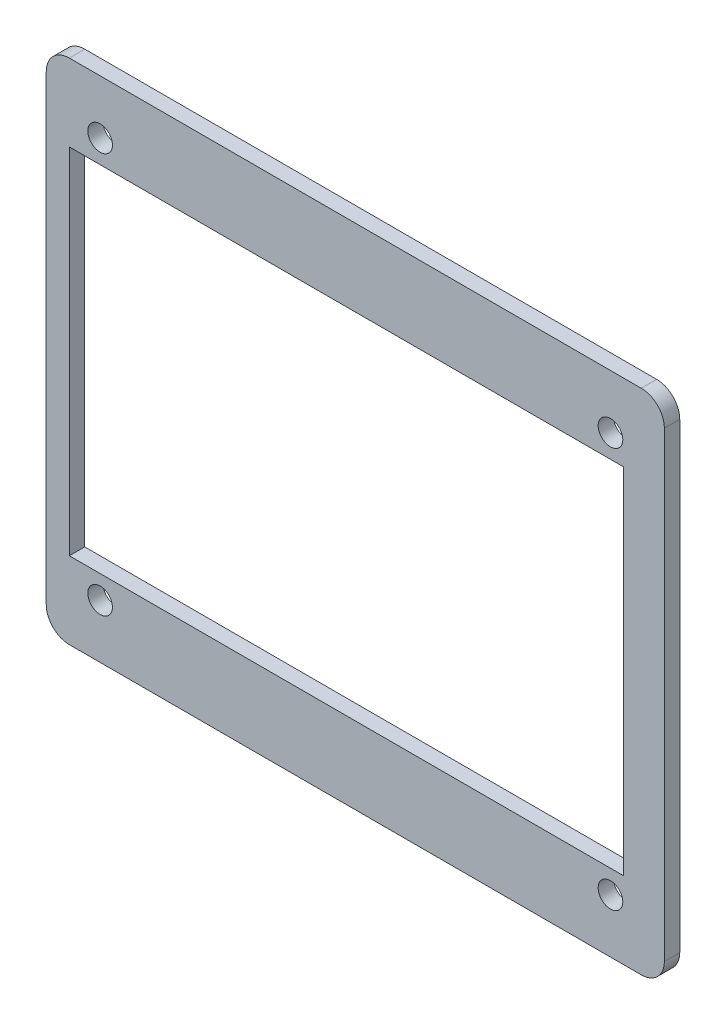
ISO-10303-21;
HEADER;
FILE_DESCRIPTION(('STEP AP214'),'2;1');
FILE_NAME('part.step','',(''),(''),'','','');
FILE_SCHEMA(('AUTOMOTIVE_DESIGN { 1 0 10303 214 1 1 1 1 }'));
ENDSEC;
DATA;
#1=APPLICATION_CONTEXT('core data for automotive mechanical design processes');
#2=APPLICATION_PROTOCOL_DEFINITION('international standard','automotive_design',2000,#1);
#3=PRODUCT_CONTEXT('',#1,'mechanical');
#4=PRODUCT('Part','Part','',(#3));
#5=PRODUCT_RELATED_PRODUCT_CATEGORY('part','',(#4));
#6=PRODUCT_DEFINITION_FORMATION('','',#4);
#7=PRODUCT_DEFINITION_CONTEXT('part definition',#1,'design');
#8=PRODUCT_DEFINITION('design','',#6,#7);
#9=PRODUCT_DEFINITION_SHAPE('','',#8);
#10=(LENGTH_UNIT() NAMED_UNIT(*) SI_UNIT(.MILLI.,.METRE.));
#11=(NAMED_UNIT(*) PLANE_ANGLE_UNIT() SI_UNIT($,.RADIAN.));
#12=(NAMED_UNIT(*) SI_UNIT($,.STERADIAN.) SOLID_ANGLE_UNIT());
#13=UNCERTAINTY_MEASURE_WITH_UNIT(LENGTH_MEASURE(1.E-05),#10,'distance_accuracy_value','');
#14=(GEOMETRIC_REPRESENTATION_CONTEXT(3) GLOBAL_UNCERTAINTY_ASSIGNED_CONTEXT((#13)) GLOBAL_UNIT_ASSIGNED_CONTEXT((#10,
#11,#12)) REPRESENTATION_CONTEXT('',''));
#15=CARTESIAN_POINT('',(0.,0.,0.));
#16=DIRECTION('',(0.,0.,1.));
#17=DIRECTION('',(1.,0.,0.));
#18=AXIS2_PLACEMENT_3D('',#15,#16,#17);
#19=CARTESIAN_POINT('',(0.,0.,2.));
#20=DIRECTION('',(1.,0.,0.));
#21=DIRECTION('',(0.,0.,-1.));
#22=AXIS2_PLACEMENT_3D('',#19,#20,#21);
#23=PLANE('',#22);
#24=DIRECTION('',(0.,-1.,0.));
#25=VECTOR('',#24,1.);
#26=CARTESIAN_POINT('',(0.,0.,0.));
#27=LINE('',#26,#25);
#28=CARTESIAN_POINT('',(0.,63.,0.));
#29=VERTEX_POINT('',#28);
#30=CARTESIAN_POINT('',(0.,3.,0.));
#31=VERTEX_POINT('',#30);
#32=EDGE_CURVE('E180',#29,#31,#27,.T.);
#33=ORIENTED_EDGE('',*,*,#32,.T.);
#34=DIRECTION('',(0.,0.,-1.));
#35=VECTOR('',#34,1.);
#36=CARTESIAN_POINT('',(0.,3.,2.));
#37=LINE('',#36,#35);
#38=CARTESIAN_POINT('',(0.,3.,2.));
#39=VERTEX_POINT('',#38);
#40=EDGE_CURVE('E11',#31,#39,#37,.F.);
#41=ORIENTED_EDGE('',*,*,#40,.T.);
#42=DIRECTION('',(0.,-1.,0.));
#43=VECTOR('',#42,1.);
#44=CARTESIAN_POINT('',(0.,0.,2.));
#45=LINE('',#44,#43);
#46=CARTESIAN_POINT('',(0.,63.,2.));
#47=VERTEX_POINT('',#46);
#48=EDGE_CURVE('E181',#47,#39,#45,.T.);
#49=ORIENTED_EDGE('',*,*,#48,.F.);
#50=DIRECTION('',(0.,0.,-1.));
#51=VECTOR('',#50,1.);
#52=CARTESIAN_POINT('',(0.,63.,2.));
#53=LINE('',#52,#51);
#54=EDGE_CURVE('E40',#47,#29,#53,.T.);
#55=ORIENTED_EDGE('',*,*,#54,.T.);
#56=EDGE_LOOP('',(#33,#41,#49,#55));
#57=FACE_BOUND('',#56,.T.);
#58=ADVANCED_FACE('F32',(#57),#23,.F.);
#59=CARTESIAN_POINT('',(0.,0.,2.));
#60=DIRECTION('',(0.,1.,0.));
#61=DIRECTION('',(0.,0.,1.));
#62=AXIS2_PLACEMENT_3D('',#59,#60,#61);
#63=PLANE('',#62);
#64=DIRECTION('',(1.,0.,0.));
#65=VECTOR('',#64,1.);
#66=CARTESIAN_POINT('',(0.,0.,0.));
#67=LINE('',#66,#65);
#68=CARTESIAN_POINT('',(3.,0.,0.));
#69=VERTEX_POINT('',#68);
#70=CARTESIAN_POINT('',(77.3,0.,0.));
#71=VERTEX_POINT('',#70);
#72=EDGE_CURVE('E197',#69,#71,#67,.T.);
#73=ORIENTED_EDGE('',*,*,#72,.T.);
#74=DIRECTION('',(0.,0.,-1.));
#75=VECTOR('',#74,1.);
#76=CARTESIAN_POINT('',(77.3,0.,2.));
#77=LINE('',#76,#75);
#78=CARTESIAN_POINT('',(77.3,0.,2.));
#79=VERTEX_POINT('',#78);
#80=EDGE_CURVE('E233',#71,#79,#77,.F.);
#81=ORIENTED_EDGE('',*,*,#80,.T.);
#82=DIRECTION('',(1.,0.,0.));
#83=VECTOR('',#82,1.);
#84=CARTESIAN_POINT('',(0.,0.,2.));
#85=LINE('',#84,#83);
#86=CARTESIAN_POINT('',(3.,0.,2.));
#87=VERTEX_POINT('',#86);
#88=EDGE_CURVE('E184',#87,#79,#85,.T.);
#89=ORIENTED_EDGE('',*,*,#88,.F.);
#90=DIRECTION('',(0.,0.,-1.));
#91=VECTOR('',#90,1.);
#92=CARTESIAN_POINT('',(3.,0.,2.));
#93=LINE('',#92,#91);
#94=EDGE_CURVE('E230',#87,#69,#93,.T.);
#95=ORIENTED_EDGE('',*,*,#94,.T.);
#96=EDGE_LOOP('',(#73,#81,#89,#95));
#97=FACE_BOUND('',#96,.T.);
#98=ADVANCED_FACE('F251',(#97),#63,.F.);
#99=CARTESIAN_POINT('',(80.3,0.,2.));
#100=DIRECTION('',(-1.,0.,0.));
#101=DIRECTION('',(0.,0.,1.));
#102=AXIS2_PLACEMENT_3D('',#99,#100,#101);
#103=PLANE('',#102);
#104=DIRECTION('',(0.,1.,0.));
#105=VECTOR('',#104,1.);
#106=CARTESIAN_POINT('',(80.3,0.,0.));
#107=LINE('',#106,#105);
#108=CARTESIAN_POINT('',(80.3,3.,0.));
#109=VERTEX_POINT('',#108);
#110=CARTESIAN_POINT('',(80.3,63.,0.));
#111=VERTEX_POINT('',#110);
#112=EDGE_CURVE('E200',#109,#111,#107,.T.);
#113=ORIENTED_EDGE('',*,*,#112,.T.);
#114=DIRECTION('',(0.,0.,-1.));
#115=VECTOR('',#114,1.);
#116=CARTESIAN_POINT('',(80.3,63.,2.));
#117=LINE('',#116,#115);
#118=CARTESIAN_POINT('',(80.3,63.,2.));
#119=VERTEX_POINT('',#118);
#120=EDGE_CURVE('E220',#111,#119,#117,.F.);
#121=ORIENTED_EDGE('',*,*,#120,.T.);
#122=DIRECTION('',(0.,1.,0.));
#123=VECTOR('',#122,1.);
#124=CARTESIAN_POINT('',(80.3,0.,2.));
#125=LINE('',#124,#123);
#126=CARTESIAN_POINT('',(80.3,3.,2.));
#127=VERTEX_POINT('',#126);
#128=EDGE_CURVE('E188',#127,#119,#125,.T.);
#129=ORIENTED_EDGE('',*,*,#128,.F.);
#130=DIRECTION('',(0.,0.,-1.));
#131=VECTOR('',#130,1.);
#132=CARTESIAN_POINT('',(80.3,3.,2.));
#133=LINE('',#132,#131);
#134=EDGE_CURVE('E217',#127,#109,#133,.T.);
#135=ORIENTED_EDGE('',*,*,#134,.T.);
#136=EDGE_LOOP('',(#113,#121,#129,#135));
#137=FACE_BOUND('',#136,.T.);
#138=ADVANCED_FACE('F262',(#137),#103,.F.);
#139=CARTESIAN_POINT('',(0.,66.,2.));
#140=DIRECTION('',(0.,-1.,0.));
#141=DIRECTION('',(0.,0.,-1.));
#142=AXIS2_PLACEMENT_3D('',#139,#140,#141);
#143=PLANE('',#142);
#144=DIRECTION('',(-1.,0.,0.));
#145=VECTOR('',#144,1.);
#146=CARTESIAN_POINT('',(0.,66.,2.));
#147=LINE('',#146,#145);
#148=CARTESIAN_POINT('',(77.3,66.,2.));
#149=VERTEX_POINT('',#148);
#150=CARTESIAN_POINT('',(3.,66.,2.));
#151=VERTEX_POINT('',#150);
#152=EDGE_CURVE('E191',#149,#151,#147,.T.);
#153=ORIENTED_EDGE('',*,*,#152,.F.);
#154=DIRECTION('',(0.,0.,-1.));
#155=VECTOR('',#154,1.);
#156=CARTESIAN_POINT('',(77.3,66.,2.));
#157=LINE('',#156,#155);
#158=CARTESIAN_POINT('',(77.3,66.,0.));
#159=VERTEX_POINT('',#158);
#160=EDGE_CURVE('E206',#149,#159,#157,.T.);
#161=ORIENTED_EDGE('',*,*,#160,.T.);
#162=DIRECTION('',(-1.,0.,0.));
#163=VECTOR('',#162,1.);
#164=CARTESIAN_POINT('',(0.,66.,0.));
#165=LINE('',#164,#163);
#166=CARTESIAN_POINT('',(3.,66.,0.));
#167=VERTEX_POINT('',#166);
#168=EDGE_CURVE('E185',#159,#167,#165,.T.);
#169=ORIENTED_EDGE('',*,*,#168,.T.);
#170=DIRECTION('',(0.,0.,-1.));
#171=VECTOR('',#170,1.);
#172=CARTESIAN_POINT('',(3.,66.,2.));
#173=LINE('',#172,#171);
#174=EDGE_CURVE('E194',#167,#151,#173,.F.);
#175=ORIENTED_EDGE('',*,*,#174,.T.);
#176=EDGE_LOOP('',(#153,#161,#169,#175));
#177=FACE_BOUND('',#176,.T.);
#178=ADVANCED_FACE('F270',(#177),#143,.F.);
#179=CARTESIAN_POINT('',(0.,0.,2.));
#180=DIRECTION('',(0.,0.,-1.));
#181=DIRECTION('',(-1.,0.,0.));
#182=AXIS2_PLACEMENT_3D('',#179,#180,#181);
#183=PLANE('',#182);
#184=DIRECTION('',(1.,0.,0.));
#185=VECTOR('',#184,1.);
#186=CARTESIAN_POINT('',(3.,10.,2.));
#187=LINE('',#186,#185);
#188=CARTESIAN_POINT('',(3.,10.,2.));
#189=VERTEX_POINT('',#188);
#190=CARTESIAN_POINT('',(75.,10.,2.));
#191=VERTEX_POINT('',#190);
#192=EDGE_CURVE('E147',#189,#191,#187,.T.);
#193=ORIENTED_EDGE('',*,*,#192,.F.);
#194=DIRECTION('',(0.,-1.,0.));
#195=VECTOR('',#194,1.);
#196=CARTESIAN_POINT('',(3.,10.,2.));
#197=LINE('',#196,#195);
#198=CARTESIAN_POINT('',(3.,56.,2.));
#199=VERTEX_POINT('',#198);
#200=EDGE_CURVE('E47',#199,#189,#197,.T.);
#201=ORIENTED_EDGE('',*,*,#200,.F.);
#202=DIRECTION('',(-1.,0.,0.));
#203=VECTOR('',#202,1.);
#204=CARTESIAN_POINT('',(3.,56.,2.));
#205=LINE('',#204,#203);
#206=CARTESIAN_POINT('',(75.,56.,2.));
#207=VERTEX_POINT('',#206);
#208=EDGE_CURVE('E138',#207,#199,#205,.T.);
#209=ORIENTED_EDGE('',*,*,#208,.F.);
#210=DIRECTION('',(0.,1.,0.));
#211=VECTOR('',#210,1.);
#212=CARTESIAN_POINT('',(75.,10.,2.));
#213=LINE('',#212,#211);
#214=EDGE_CURVE('E141',#191,#207,#213,.T.);
#215=ORIENTED_EDGE('',*,*,#214,.F.);
#216=EDGE_LOOP('',(#193,#201,#209,#215));
#217=FACE_BOUND('',#216,.T.);
#218=CARTESIAN_POINT('',(7.,59.,2.));
#219=DIRECTION('',(0.,0.,1.));
#220=DIRECTION('',(1.,0.,0.));
#221=AXIS2_PLACEMENT_3D('',#218,#219,#220);
#222=CIRCLE('',#221,1.59999999999999);
#223=CARTESIAN_POINT('',(8.59999999999999,59.,2.));
#224=VERTEX_POINT('',#223);
#225=EDGE_CURVE('E153',#224,#224,#222,.T.);
#226=ORIENTED_EDGE('',*,*,#225,.F.);
#227=EDGE_LOOP('',(#226));
#228=FACE_BOUND('',#227,.T.);
#229=CARTESIAN_POINT('',(73.3,59.,2.));
#230=DIRECTION('',(0.,0.,1.));
#231=DIRECTION('',(1.,0.,0.));
#232=AXIS2_PLACEMENT_3D('',#229,#230,#231);
#233=CIRCLE('',#232,1.59999999999999);
#234=CARTESIAN_POINT('',(74.9,59.,2.));
#235=VERTEX_POINT('',#234);
#236=EDGE_CURVE('E162',#235,#235,#233,.T.);
#237=ORIENTED_EDGE('',*,*,#236,.F.);
#238=EDGE_LOOP('',(#237));
#239=FACE_BOUND('',#238,.T.);
#240=CARTESIAN_POINT('',(73.3,7.,2.));
#241=DIRECTION('',(0.,0.,1.));
#242=DIRECTION('',(1.,0.,0.));
#243=AXIS2_PLACEMENT_3D('',#240,#241,#242);
#244=CIRCLE('',#243,1.59999999999999);
#245=CARTESIAN_POINT('',(74.9,7.,2.));
#246=VERTEX_POINT('',#245);
#247=EDGE_CURVE('E168',#246,#246,#244,.T.);
#248=ORIENTED_EDGE('',*,*,#247,.F.);
#249=EDGE_LOOP('',(#248));
#250=FACE_BOUND('',#249,.T.);
#251=CARTESIAN_POINT('',(7.00000000000001,7.,2.));
#252=DIRECTION('',(0.,0.,1.));
#253=DIRECTION('',(1.,0.,0.));
#254=AXIS2_PLACEMENT_3D('',#251,#252,#253);
#255=CIRCLE('',#254,1.59999999999999);
#256=CARTESIAN_POINT('',(8.59999999999999,7.,2.));
#257=VERTEX_POINT('',#256);
#258=EDGE_CURVE('E174',#257,#257,#255,.T.);
#259=ORIENTED_EDGE('',*,*,#258,.F.);
#260=EDGE_LOOP('',(#259));
#261=FACE_BOUND('',#260,.T.);
#262=ORIENTED_EDGE('',*,*,#128,.T.);
#263=CARTESIAN_POINT('',(77.3,63.,2.));
#264=DIRECTION('',(0.,0.,-1.));
#265=DIRECTION('',(-1.,0.,0.));
#266=AXIS2_PLACEMENT_3D('',#263,#264,#265);
#267=CIRCLE('',#266,3.);
#268=EDGE_CURVE('E228',#119,#149,#267,.F.);
#269=ORIENTED_EDGE('',*,*,#268,.T.);
#270=ORIENTED_EDGE('',*,*,#152,.T.);
#271=CARTESIAN_POINT('',(3.,63.,2.));
#272=DIRECTION('',(0.,0.,-1.));
#273=DIRECTION('',(-1.,0.,0.));
#274=AXIS2_PLACEMENT_3D('',#271,#272,#273);
#275=CIRCLE('',#274,3.);
#276=EDGE_CURVE('E222',#151,#47,#275,.F.);
#277=ORIENTED_EDGE('',*,*,#276,.T.);
#278=ORIENTED_EDGE('',*,*,#48,.T.);
#279=CARTESIAN_POINT('',(3.,3.,2.));
#280=DIRECTION('',(0.,0.,-1.));
#281=DIRECTION('',(-1.,0.,0.));
#282=AXIS2_PLACEMENT_3D('',#279,#280,#281);
#283=CIRCLE('',#282,3.);
#284=EDGE_CURVE('E224',#39,#87,#283,.F.);
#285=ORIENTED_EDGE('',*,*,#284,.T.);
#286=ORIENTED_EDGE('',*,*,#88,.T.);
#287=CARTESIAN_POINT('',(77.3,3.,2.));
#288=DIRECTION('',(0.,0.,-1.));
#289=DIRECTION('',(-1.,0.,0.));
#290=AXIS2_PLACEMENT_3D('',#287,#288,#289);
#291=CIRCLE('',#290,3.);
#292=EDGE_CURVE('E226',#79,#127,#291,.F.);
#293=ORIENTED_EDGE('',*,*,#292,.T.);
#294=EDGE_LOOP('',(#262,#269,#270,#277,#278,#285,#286,#293));
#295=FACE_BOUND('',#294,.T.);
#296=ADVANCED_FACE('F255',(#217,#228,#239,#250,#261,#295),#183,.F.);
#297=CARTESIAN_POINT('',(0.,0.,0.));
#298=DIRECTION('',(0.,0.,-1.));
#299=DIRECTION('',(-1.,0.,0.));
#300=AXIS2_PLACEMENT_3D('',#297,#298,#299);
#301=PLANE('',#300);
#302=DIRECTION('',(0.,-1.,0.));
#303=VECTOR('',#302,1.);
#304=CARTESIAN_POINT('',(3.,10.,0.));
#305=LINE('',#304,#303);
#306=CARTESIAN_POINT('',(3.,56.,0.));
#307=VERTEX_POINT('',#306);
#308=CARTESIAN_POINT('',(3.,10.,0.));
#309=VERTEX_POINT('',#308);
#310=EDGE_CURVE('E122',#307,#309,#305,.T.);
#311=ORIENTED_EDGE('',*,*,#310,.T.);
#312=DIRECTION('',(1.,0.,0.));
#313=VECTOR('',#312,1.);
#314=CARTESIAN_POINT('',(3.,10.,0.));
#315=LINE('',#314,#313);
#316=CARTESIAN_POINT('',(75.,10.,0.));
#317=VERTEX_POINT('',#316);
#318=EDGE_CURVE('E131',#309,#317,#315,.T.);
#319=ORIENTED_EDGE('',*,*,#318,.T.);
#320=DIRECTION('',(0.,1.,0.));
#321=VECTOR('',#320,1.);
#322=CARTESIAN_POINT('',(75.,10.,0.));
#323=LINE('',#322,#321);
#324=CARTESIAN_POINT('',(75.,56.,0.));
#325=VERTEX_POINT('',#324);
#326=EDGE_CURVE('E55',#317,#325,#323,.T.);
#327=ORIENTED_EDGE('',*,*,#326,.T.);
#328=DIRECTION('',(-1.,0.,0.));
#329=VECTOR('',#328,1.);
#330=CARTESIAN_POINT('',(3.,56.,0.));
#331=LINE('',#330,#329);
#332=EDGE_CURVE('E128',#325,#307,#331,.T.);
#333=ORIENTED_EDGE('',*,*,#332,.T.);
#334=EDGE_LOOP('',(#311,#319,#327,#333));
#335=FACE_BOUND('',#334,.T.);
#336=CARTESIAN_POINT('',(7.,59.,0.));
#337=DIRECTION('',(0.,0.,1.));
#338=DIRECTION('',(1.,0.,0.));
#339=AXIS2_PLACEMENT_3D('',#336,#337,#338);
#340=CIRCLE('',#339,1.6);
#341=CARTESIAN_POINT('',(8.6,59.,0.));
#342=VERTEX_POINT('',#341);
#343=EDGE_CURVE('E159',#342,#342,#340,.T.);
#344=ORIENTED_EDGE('',*,*,#343,.T.);
#345=EDGE_LOOP('',(#344));
#346=FACE_BOUND('',#345,.T.);
#347=CARTESIAN_POINT('',(73.3,59.,0.));
#348=DIRECTION('',(0.,0.,1.));
#349=DIRECTION('',(1.,0.,0.));
#350=AXIS2_PLACEMENT_3D('',#347,#348,#349);
#351=CIRCLE('',#350,1.6);
#352=CARTESIAN_POINT('',(74.9,59.,0.));
#353=VERTEX_POINT('',#352);
#354=EDGE_CURVE('E165',#353,#353,#351,.T.);
#355=ORIENTED_EDGE('',*,*,#354,.T.);
#356=EDGE_LOOP('',(#355));
#357=FACE_BOUND('',#356,.T.);
#358=CARTESIAN_POINT('',(73.3,7.,0.));
#359=DIRECTION('',(0.,0.,1.));
#360=DIRECTION('',(1.,0.,0.));
#361=AXIS2_PLACEMENT_3D('',#358,#359,#360);
#362=CIRCLE('',#361,1.6);
#363=CARTESIAN_POINT('',(74.9,7.,0.));
#364=VERTEX_POINT('',#363);
#365=EDGE_CURVE('E171',#364,#364,#362,.T.);
#366=ORIENTED_EDGE('',*,*,#365,.T.);
#367=EDGE_LOOP('',(#366));
#368=FACE_BOUND('',#367,.T.);
#369=CARTESIAN_POINT('',(7.00000000000001,7.,0.));
#370=DIRECTION('',(0.,0.,1.));
#371=DIRECTION('',(1.,0.,0.));
#372=AXIS2_PLACEMENT_3D('',#369,#370,#371);
#373=CIRCLE('',#372,1.6);
#374=CARTESIAN_POINT('',(8.6,7.,0.));
#375=VERTEX_POINT('',#374);
#376=EDGE_CURVE('E177',#375,#375,#373,.T.);
#377=ORIENTED_EDGE('',*,*,#376,.T.);
#378=EDGE_LOOP('',(#377));
#379=FACE_BOUND('',#378,.T.);
#380=ORIENTED_EDGE('',*,*,#168,.F.);
#381=CARTESIAN_POINT('',(77.3,63.,0.));
#382=DIRECTION('',(0.,0.,-1.));
#383=DIRECTION('',(-1.,0.,0.));
#384=AXIS2_PLACEMENT_3D('',#381,#382,#383);
#385=CIRCLE('',#384,3.);
#386=EDGE_CURVE('E215',#159,#111,#385,.T.);
#387=ORIENTED_EDGE('',*,*,#386,.T.);
#388=ORIENTED_EDGE('',*,*,#112,.F.);
#389=CARTESIAN_POINT('',(77.3,3.,0.));
#390=DIRECTION('',(0.,0.,-1.));
#391=DIRECTION('',(-1.,0.,0.));
#392=AXIS2_PLACEMENT_3D('',#389,#390,#391);
#393=CIRCLE('',#392,3.);
#394=EDGE_CURVE('E213',#109,#71,#393,.T.);
#395=ORIENTED_EDGE('',*,*,#394,.T.);
#396=ORIENTED_EDGE('',*,*,#72,.F.);
#397=CARTESIAN_POINT('',(3.,3.,0.));
#398=DIRECTION('',(0.,0.,-1.));
#399=DIRECTION('',(-1.,0.,0.));
#400=AXIS2_PLACEMENT_3D('',#397,#398,#399);
#401=CIRCLE('',#400,3.);
#402=EDGE_CURVE('E211',#69,#31,#401,.T.);
#403=ORIENTED_EDGE('',*,*,#402,.T.);
#404=ORIENTED_EDGE('',*,*,#32,.F.);
#405=CARTESIAN_POINT('',(3.,63.,0.));
#406=DIRECTION('',(0.,0.,-1.));
#407=DIRECTION('',(-1.,0.,0.));
#408=AXIS2_PLACEMENT_3D('',#405,#406,#407);
#409=CIRCLE('',#408,3.);
#410=EDGE_CURVE('E209',#29,#167,#409,.T.);
#411=ORIENTED_EDGE('',*,*,#410,.T.);
#412=EDGE_LOOP('',(#380,#387,#388,#395,#396,#403,#404,#411));
#413=FACE_BOUND('',#412,.T.);
#414=ADVANCED_FACE('F135',(#335,#346,#357,#368,#379,#413),#301,.T.);
#415=CARTESIAN_POINT('',(7.00000000000001,7.,2.));
#416=DIRECTION('',(0.,0.,1.));
#417=DIRECTION('',(1.,0.,0.));
#418=AXIS2_PLACEMENT_3D('',#415,#416,#417);
#419=CYLINDRICAL_SURFACE('',#418,1.59999999999999);
#420=ORIENTED_EDGE('',*,*,#376,.F.);
#421=EDGE_LOOP('',(#420));
#422=FACE_BOUND('',#421,.T.);
#423=ORIENTED_EDGE('',*,*,#258,.T.);
#424=EDGE_LOOP('',(#423));
#425=FACE_BOUND('',#424,.T.);
#426=ADVANCED_FACE('F325',(#422,#425),#419,.F.);
#427=CARTESIAN_POINT('',(73.3,7.,2.));
#428=DIRECTION('',(0.,0.,1.));
#429=DIRECTION('',(1.,0.,0.));
#430=AXIS2_PLACEMENT_3D('',#427,#428,#429);
#431=CYLINDRICAL_SURFACE('',#430,1.6);
#432=ORIENTED_EDGE('',*,*,#365,.F.);
#433=EDGE_LOOP('',(#432));
#434=FACE_BOUND('',#433,.T.);
#435=ORIENTED_EDGE('',*,*,#247,.T.);
#436=EDGE_LOOP('',(#435));
#437=FACE_BOUND('',#436,.T.);
#438=ADVANCED_FACE('F368',(#434,#437),#431,.F.);
#439=CARTESIAN_POINT('',(73.3,59.,2.));
#440=DIRECTION('',(0.,0.,1.));
#441=DIRECTION('',(1.,0.,0.));
#442=AXIS2_PLACEMENT_3D('',#439,#440,#441);
#443=CYLINDRICAL_SURFACE('',#442,1.6);
#444=ORIENTED_EDGE('',*,*,#354,.F.);
#445=EDGE_LOOP('',(#444));
#446=FACE_BOUND('',#445,.T.);
#447=ORIENTED_EDGE('',*,*,#236,.T.);
#448=EDGE_LOOP('',(#447));
#449=FACE_BOUND('',#448,.T.);
#450=ADVANCED_FACE('F364',(#446,#449),#443,.F.);
#451=CARTESIAN_POINT('',(7.,59.,2.));
#452=DIRECTION('',(0.,0.,1.));
#453=DIRECTION('',(1.,0.,0.));
#454=AXIS2_PLACEMENT_3D('',#451,#452,#453);
#455=CYLINDRICAL_SURFACE('',#454,1.59999999999999);
#456=ORIENTED_EDGE('',*,*,#343,.F.);
#457=EDGE_LOOP('',(#456));
#458=FACE_BOUND('',#457,.T.);
#459=ORIENTED_EDGE('',*,*,#225,.T.);
#460=EDGE_LOOP('',(#459));
#461=FACE_BOUND('',#460,.T.);
#462=ADVANCED_FACE('F289',(#458,#461),#455,.F.);
#463=CARTESIAN_POINT('',(77.3,63.,2.));
#464=DIRECTION('',(0.,0.,-1.));
#465=DIRECTION('',(-1.,0.,0.));
#466=AXIS2_PLACEMENT_3D('',#463,#464,#465);
#467=CYLINDRICAL_SURFACE('',#466,3.);
#468=ORIENTED_EDGE('',*,*,#268,.F.);
#469=ORIENTED_EDGE('',*,*,#120,.F.);
#470=ORIENTED_EDGE('',*,*,#386,.F.);
#471=ORIENTED_EDGE('',*,*,#160,.F.);
#472=EDGE_LOOP('',(#468,#469,#470,#471));
#473=FACE_BOUND('',#472,.T.);
#474=ADVANCED_FACE('F267',(#473),#467,.T.);
#475=CARTESIAN_POINT('',(77.3,3.,2.));
#476=DIRECTION('',(0.,0.,-1.));
#477=DIRECTION('',(-1.,0.,0.));
#478=AXIS2_PLACEMENT_3D('',#475,#476,#477);
#479=CYLINDRICAL_SURFACE('',#478,3.);
#480=ORIENTED_EDGE('',*,*,#292,.F.);
#481=ORIENTED_EDGE('',*,*,#80,.F.);
#482=ORIENTED_EDGE('',*,*,#394,.F.);
#483=ORIENTED_EDGE('',*,*,#134,.F.);
#484=EDGE_LOOP('',(#480,#481,#482,#483));
#485=FACE_BOUND('',#484,.T.);
#486=ADVANCED_FACE('F259',(#485),#479,.T.);
#487=CARTESIAN_POINT('',(3.,3.,2.));
#488=DIRECTION('',(0.,0.,-1.));
#489=DIRECTION('',(-1.,0.,0.));
#490=AXIS2_PLACEMENT_3D('',#487,#488,#489);
#491=CYLINDRICAL_SURFACE('',#490,3.);
#492=ORIENTED_EDGE('',*,*,#284,.F.);
#493=ORIENTED_EDGE('',*,*,#40,.F.);
#494=ORIENTED_EDGE('',*,*,#402,.F.);
#495=ORIENTED_EDGE('',*,*,#94,.F.);
#496=EDGE_LOOP('',(#492,#493,#494,#495));
#497=FACE_BOUND('',#496,.T.);
#498=ADVANCED_FACE('F248',(#497),#491,.T.);
#499=CARTESIAN_POINT('',(3.,63.,2.));
#500=DIRECTION('',(0.,0.,-1.));
#501=DIRECTION('',(-1.,0.,0.));
#502=AXIS2_PLACEMENT_3D('',#499,#500,#501);
#503=CYLINDRICAL_SURFACE('',#502,3.);
#504=ORIENTED_EDGE('',*,*,#276,.F.);
#505=ORIENTED_EDGE('',*,*,#174,.F.);
#506=ORIENTED_EDGE('',*,*,#410,.F.);
#507=ORIENTED_EDGE('',*,*,#54,.F.);
#508=EDGE_LOOP('',(#504,#505,#506,#507));
#509=FACE_BOUND('',#508,.T.);
#510=ADVANCED_FACE('F34',(#509),#503,.T.);
#511=CARTESIAN_POINT('',(3.,10.,0.));
#512=DIRECTION('',(-1.,0.,0.));
#513=DIRECTION('',(0.,0.,1.));
#514=AXIS2_PLACEMENT_3D('',#511,#512,#513);
#515=PLANE('',#514);
#516=ORIENTED_EDGE('',*,*,#200,.T.);
#517=DIRECTION('',(0.,0.,1.));
#518=VECTOR('',#517,1.);
#519=CARTESIAN_POINT('',(3.,10.,0.));
#520=LINE('',#519,#518);
#521=EDGE_CURVE('E118',#309,#189,#520,.T.);
#522=ORIENTED_EDGE('',*,*,#521,.F.);
#523=ORIENTED_EDGE('',*,*,#310,.F.);
#524=DIRECTION('',(0.,0.,1.));
#525=VECTOR('',#524,1.);
#526=CARTESIAN_POINT('',(3.,56.,0.));
#527=LINE('',#526,#525);
#528=EDGE_CURVE('E151',#307,#199,#527,.T.);
#529=ORIENTED_EDGE('',*,*,#528,.T.);
#530=EDGE_LOOP('',(#516,#522,#523,#529));
#531=FACE_BOUND('',#530,.T.);
#532=ADVANCED_FACE('F120',(#531),#515,.F.);
#533=CARTESIAN_POINT('',(3.,56.,0.));
#534=DIRECTION('',(0.,1.,0.));
#535=DIRECTION('',(-1.,0.,0.));
#536=AXIS2_PLACEMENT_3D('',#533,#534,#535);
#537=PLANE('',#536);
#538=ORIENTED_EDGE('',*,*,#208,.T.);
#539=ORIENTED_EDGE('',*,*,#528,.F.);
#540=ORIENTED_EDGE('',*,*,#332,.F.);
#541=DIRECTION('',(0.,0.,1.));
#542=VECTOR('',#541,1.);
#543=CARTESIAN_POINT('',(75.,56.,0.));
#544=LINE('',#543,#542);
#545=EDGE_CURVE('E154',#325,#207,#544,.T.);
#546=ORIENTED_EDGE('',*,*,#545,.T.);
#547=EDGE_LOOP('',(#538,#539,#540,#546));
#548=FACE_BOUND('',#547,.T.);
#549=ADVANCED_FACE('F277',(#548),#537,.F.);
#550=CARTESIAN_POINT('',(75.,10.,0.));
#551=DIRECTION('',(1.,0.,0.));
#552=DIRECTION('',(0.,0.,-1.));
#553=AXIS2_PLACEMENT_3D('',#550,#551,#552);
#554=PLANE('',#553);
#555=ORIENTED_EDGE('',*,*,#214,.T.);
#556=ORIENTED_EDGE('',*,*,#545,.F.);
#557=ORIENTED_EDGE('',*,*,#326,.F.);
#558=DIRECTION('',(0.,0.,1.));
#559=VECTOR('',#558,1.);
#560=CARTESIAN_POINT('',(75.,10.,0.));
#561=LINE('',#560,#559);
#562=EDGE_CURVE('E127',#317,#191,#561,.T.);
#563=ORIENTED_EDGE('',*,*,#562,.T.);
#564=EDGE_LOOP('',(#555,#556,#557,#563));
#565=FACE_BOUND('',#564,.T.);
#566=ADVANCED_FACE('F341',(#565),#554,.F.);
#567=CARTESIAN_POINT('',(3.,10.,0.));
#568=DIRECTION('',(0.,-1.,0.));
#569=DIRECTION('',(1.,0.,0.));
#570=AXIS2_PLACEMENT_3D('',#567,#568,#569);
#571=PLANE('',#570);
#572=ORIENTED_EDGE('',*,*,#192,.T.);
#573=ORIENTED_EDGE('',*,*,#562,.F.);
#574=ORIENTED_EDGE('',*,*,#318,.F.);
#575=ORIENTED_EDGE('',*,*,#521,.T.);
#576=EDGE_LOOP('',(#572,#573,#574,#575));
#577=FACE_BOUND('',#576,.T.);
#578=ADVANCED_FACE('F132',(#577),#571,.F.);
#579=CLOSED_SHELL('',(#58,#98,#138,#178,#296,#414,#426,#438,#450,#462,#474,#486,#498,#510,#532,
#549,#566,#578));
#580=MANIFOLD_SOLID_BREP('B2',#579);
#581=ADVANCED_BREP_SHAPE_REPRESENTATION('',(#18,#580),#14);
#582=SHAPE_DEFINITION_REPRESENTATION(#9,#581);
ENDSEC;
END-ISO-10303-21;
